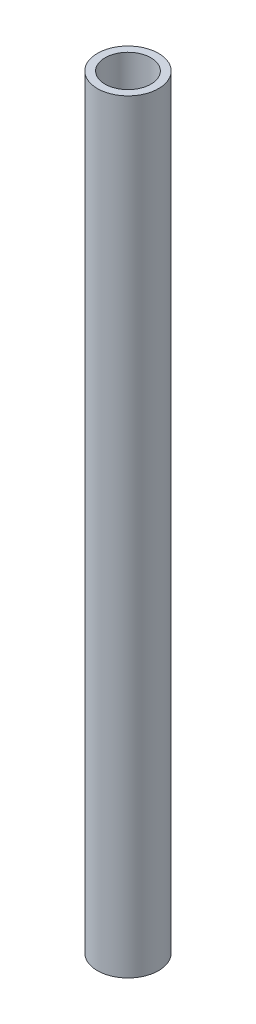
ISO-10303-21;
HEADER;
FILE_DESCRIPTION(('STEP AP214'),'2;1');
FILE_NAME('part.step','',(''),(''),'','','');
FILE_SCHEMA(('AUTOMOTIVE_DESIGN { 1 0 10303 214 1 1 1 1 }'));
ENDSEC;
DATA;
#1=APPLICATION_CONTEXT('core data for automotive mechanical design processes');
#2=APPLICATION_PROTOCOL_DEFINITION('international standard','automotive_design',2000,#1);
#3=PRODUCT_CONTEXT('',#1,'mechanical');
#4=PRODUCT('Part','Part','',(#3));
#5=PRODUCT_RELATED_PRODUCT_CATEGORY('part','',(#4));
#6=PRODUCT_DEFINITION_FORMATION('','',#4);
#7=PRODUCT_DEFINITION_CONTEXT('part definition',#1,'design');
#8=PRODUCT_DEFINITION('design','',#6,#7);
#9=PRODUCT_DEFINITION_SHAPE('','',#8);
#10=(LENGTH_UNIT() NAMED_UNIT(*) SI_UNIT(.MILLI.,.METRE.));
#11=(NAMED_UNIT(*) PLANE_ANGLE_UNIT() SI_UNIT($,.RADIAN.));
#12=(NAMED_UNIT(*) SI_UNIT($,.STERADIAN.) SOLID_ANGLE_UNIT());
#13=UNCERTAINTY_MEASURE_WITH_UNIT(LENGTH_MEASURE(1.E-05),#10,'distance_accuracy_value','');
#14=(GEOMETRIC_REPRESENTATION_CONTEXT(3) GLOBAL_UNCERTAINTY_ASSIGNED_CONTEXT((#13)) GLOBAL_UNIT_ASSIGNED_CONTEXT((#10,
#11,#12)) REPRESENTATION_CONTEXT('',''));
#15=CARTESIAN_POINT('',(0.,0.,0.));
#16=DIRECTION('',(0.,0.,1.));
#17=DIRECTION('',(1.,0.,0.));
#18=AXIS2_PLACEMENT_3D('',#15,#16,#17);
#19=CARTESIAN_POINT('',(0.,250.,0.));
#20=DIRECTION('',(0.,1.,0.));
#21=DIRECTION('',(0.,0.,1.));
#22=AXIS2_PLACEMENT_3D('',#19,#20,#21);
#23=PLANE('',#22);
#24=CARTESIAN_POINT('',(0.,250.,0.));
#25=DIRECTION('',(0.,1.,0.));
#26=DIRECTION('',(0.,0.,1.));
#27=AXIS2_PLACEMENT_3D('',#24,#25,#26);
#28=CIRCLE('',#27,10.);
#29=CARTESIAN_POINT('',(0.,250.,10.));
#30=VERTEX_POINT('',#29);
#31=EDGE_CURVE('E10',#30,#30,#28,.T.);
#32=ORIENTED_EDGE('',*,*,#31,.T.);
#33=EDGE_LOOP('',(#32));
#34=FACE_BOUND('',#33,.T.);
#35=CARTESIAN_POINT('',(0.,250.,0.));
#36=DIRECTION('',(0.,1.,0.));
#37=DIRECTION('',(0.,0.,1.));
#38=AXIS2_PLACEMENT_3D('',#35,#36,#37);
#39=CIRCLE('',#38,7.5);
#40=CARTESIAN_POINT('',(0.,250.,7.5));
#41=VERTEX_POINT('',#40);
#42=EDGE_CURVE('E44',#41,#41,#39,.T.);
#43=ORIENTED_EDGE('',*,*,#42,.F.);
#44=EDGE_LOOP('',(#43));
#45=FACE_BOUND('',#44,.T.);
#46=ADVANCED_FACE('F33',(#34,#45),#23,.T.);
#47=CARTESIAN_POINT('',(0.,0.,0.));
#48=DIRECTION('',(0.,1.,0.));
#49=DIRECTION('',(0.,0.,1.));
#50=AXIS2_PLACEMENT_3D('',#47,#48,#49);
#51=PLANE('',#50);
#52=CARTESIAN_POINT('',(0.,0.,0.));
#53=DIRECTION('',(0.,1.,0.));
#54=DIRECTION('',(0.,0.,1.));
#55=AXIS2_PLACEMENT_3D('',#52,#53,#54);
#56=CIRCLE('',#55,10.);
#57=CARTESIAN_POINT('',(0.,0.,10.));
#58=VERTEX_POINT('',#57);
#59=EDGE_CURVE('E37',#58,#58,#56,.T.);
#60=ORIENTED_EDGE('',*,*,#59,.F.);
#61=EDGE_LOOP('',(#60));
#62=FACE_BOUND('',#61,.T.);
#63=CARTESIAN_POINT('',(0.,0.,0.));
#64=DIRECTION('',(0.,1.,0.));
#65=DIRECTION('',(0.,0.,1.));
#66=AXIS2_PLACEMENT_3D('',#63,#64,#65);
#67=CIRCLE('',#66,7.5);
#68=CARTESIAN_POINT('',(0.,0.,7.5));
#69=VERTEX_POINT('',#68);
#70=EDGE_CURVE('E46',#69,#69,#67,.T.);
#71=ORIENTED_EDGE('',*,*,#70,.T.);
#72=EDGE_LOOP('',(#71));
#73=FACE_BOUND('',#72,.T.);
#74=ADVANCED_FACE('F56',(#62,#73),#51,.F.);
#75=CARTESIAN_POINT('',(0.,250.,0.));
#76=DIRECTION('',(0.,-1.,0.));
#77=DIRECTION('',(0.,0.,-1.));
#78=AXIS2_PLACEMENT_3D('',#75,#76,#77);
#79=CYLINDRICAL_SURFACE('',#78,10.);
#80=ORIENTED_EDGE('',*,*,#31,.F.);
#81=EDGE_LOOP('',(#80));
#82=FACE_BOUND('',#81,.T.);
#83=ORIENTED_EDGE('',*,*,#59,.T.);
#84=EDGE_LOOP('',(#83));
#85=FACE_BOUND('',#84,.T.);
#86=ADVANCED_FACE('F35',(#82,#85),#79,.T.);
#87=CARTESIAN_POINT('',(0.,250.,0.));
#88=DIRECTION('',(0.,-1.,0.));
#89=DIRECTION('',(0.,0.,-1.));
#90=AXIS2_PLACEMENT_3D('',#87,#88,#89);
#91=CYLINDRICAL_SURFACE('',#90,7.5);
#92=ORIENTED_EDGE('',*,*,#42,.T.);
#93=EDGE_LOOP('',(#92));
#94=FACE_BOUND('',#93,.T.);
#95=ORIENTED_EDGE('',*,*,#70,.F.);
#96=EDGE_LOOP('',(#95));
#97=FACE_BOUND('',#96,.T.);
#98=ADVANCED_FACE('F52',(#94,#97),#91,.F.);
#99=CLOSED_SHELL('',(#46,#74,#86,#98));
#100=MANIFOLD_SOLID_BREP('B2',#99);
#101=ADVANCED_BREP_SHAPE_REPRESENTATION('',(#18,#100),#14);
#102=SHAPE_DEFINITION_REPRESENTATION(#9,#101);
ENDSEC;
END-ISO-10303-21;
